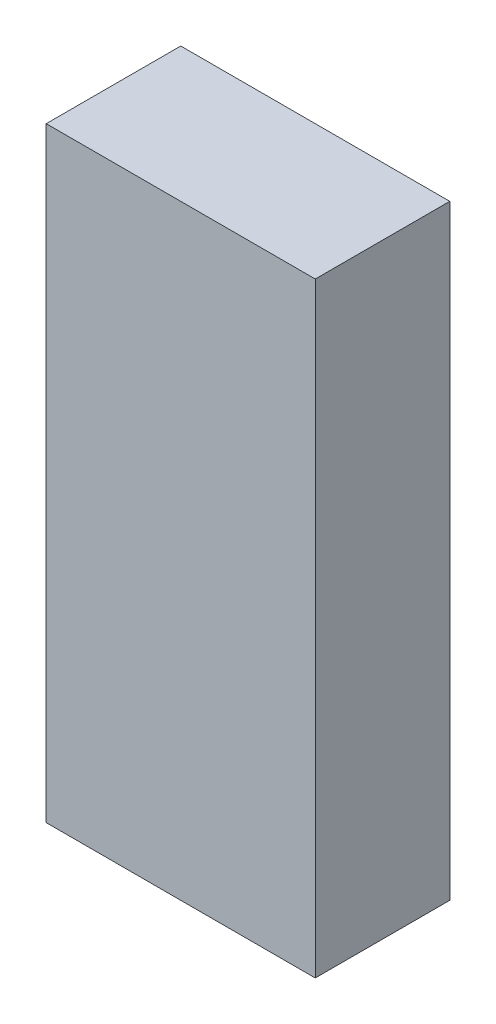
ISO-10303-21;
HEADER;
FILE_DESCRIPTION(('STEP AP214'),'2;1');
FILE_NAME('part.step','',(''),(''),'','','');
FILE_SCHEMA(('AUTOMOTIVE_DESIGN { 1 0 10303 214 1 1 1 1 }'));
ENDSEC;
DATA;
#1=APPLICATION_CONTEXT('core data for automotive mechanical design processes');
#2=APPLICATION_PROTOCOL_DEFINITION('international standard','automotive_design',2000,#1);
#3=PRODUCT_CONTEXT('',#1,'mechanical');
#4=PRODUCT('Part','Part','',(#3));
#5=PRODUCT_RELATED_PRODUCT_CATEGORY('part','',(#4));
#6=PRODUCT_DEFINITION_FORMATION('','',#4);
#7=PRODUCT_DEFINITION_CONTEXT('part definition',#1,'design');
#8=PRODUCT_DEFINITION('design','',#6,#7);
#9=PRODUCT_DEFINITION_SHAPE('','',#8);
#10=(LENGTH_UNIT() NAMED_UNIT(*) SI_UNIT(.MILLI.,.METRE.));
#11=(NAMED_UNIT(*) PLANE_ANGLE_UNIT() SI_UNIT($,.RADIAN.));
#12=(NAMED_UNIT(*) SI_UNIT($,.STERADIAN.) SOLID_ANGLE_UNIT());
#13=UNCERTAINTY_MEASURE_WITH_UNIT(LENGTH_MEASURE(1.E-05),#10,'distance_accuracy_value','');
#14=(GEOMETRIC_REPRESENTATION_CONTEXT(3) GLOBAL_UNCERTAINTY_ASSIGNED_CONTEXT((#13)) GLOBAL_UNIT_ASSIGNED_CONTEXT((#10,
#11,#12)) REPRESENTATION_CONTEXT('',''));
#15=CARTESIAN_POINT('',(0.,0.,0.));
#16=DIRECTION('',(0.,0.,1.));
#17=DIRECTION('',(1.,0.,0.));
#18=AXIS2_PLACEMENT_3D('',#15,#16,#17);
#19=CARTESIAN_POINT('',(-0.6,2.525,0.));
#20=DIRECTION('',(1.,0.,0.));
#21=DIRECTION('',(0.,0.,1.));
#22=AXIS2_PLACEMENT_3D('',#19,#20,#21);
#23=PLANE('',#22);
#24=DIRECTION('',(0.,1.,0.));
#25=VECTOR('',#24,1.);
#26=CARTESIAN_POINT('',(-0.6,2.525,0.1));
#27=LINE('',#26,#25);
#28=CARTESIAN_POINT('',(-0.6,2.525,0.1));
#29=VERTEX_POINT('',#28);
#30=CARTESIAN_POINT('',(-0.6,2.975,0.1));
#31=VERTEX_POINT('',#30);
#32=EDGE_CURVE('E11',#29,#31,#27,.T.);
#33=ORIENTED_EDGE('',*,*,#32,.T.);
#34=DIRECTION('',(0.,0.,1.));
#35=VECTOR('',#34,1.);
#36=CARTESIAN_POINT('',(-0.6,2.975,0.));
#37=LINE('',#36,#35);
#38=CARTESIAN_POINT('',(-0.6,2.975,0.));
#39=VERTEX_POINT('',#38);
#40=EDGE_CURVE('E24',#39,#31,#37,.T.);
#41=ORIENTED_EDGE('',*,*,#40,.F.);
#42=DIRECTION('',(0.,1.,0.));
#43=VECTOR('',#42,1.);
#44=CARTESIAN_POINT('',(-0.6,2.525,0.));
#45=LINE('',#44,#43);
#46=CARTESIAN_POINT('',(-0.6,2.525,0.));
#47=VERTEX_POINT('',#46);
#48=EDGE_CURVE('E86',#47,#39,#45,.T.);
#49=ORIENTED_EDGE('',*,*,#48,.F.);
#50=DIRECTION('',(0.,0.,1.));
#51=VECTOR('',#50,1.);
#52=CARTESIAN_POINT('',(-0.6,2.525,0.));
#53=LINE('',#52,#51);
#54=EDGE_CURVE('E36',#47,#29,#53,.T.);
#55=ORIENTED_EDGE('',*,*,#54,.T.);
#56=EDGE_LOOP('',(#33,#41,#49,#55));
#57=FACE_BOUND('',#56,.T.);
#58=ADVANCED_FACE('F17',(#57),#23,.F.);
#59=CARTESIAN_POINT('',(-0.4,2.525,0.));
#60=DIRECTION('',(1.,0.,0.));
#61=DIRECTION('',(0.,0.,1.));
#62=AXIS2_PLACEMENT_3D('',#59,#60,#61);
#63=PLANE('',#62);
#64=DIRECTION('',(0.,0.,1.));
#65=VECTOR('',#64,1.);
#66=CARTESIAN_POINT('',(-0.4,2.525,0.));
#67=LINE('',#66,#65);
#68=CARTESIAN_POINT('',(-0.4,2.525,0.));
#69=VERTEX_POINT('',#68);
#70=CARTESIAN_POINT('',(-0.4,2.525,0.1));
#71=VERTEX_POINT('',#70);
#72=EDGE_CURVE('E83',#69,#71,#67,.T.);
#73=ORIENTED_EDGE('',*,*,#72,.F.);
#74=DIRECTION('',(0.,1.,0.));
#75=VECTOR('',#74,1.);
#76=CARTESIAN_POINT('',(-0.4,2.525,0.));
#77=LINE('',#76,#75);
#78=CARTESIAN_POINT('',(-0.4,2.975,0.));
#79=VERTEX_POINT('',#78);
#80=EDGE_CURVE('E63',#69,#79,#77,.T.);
#81=ORIENTED_EDGE('',*,*,#80,.T.);
#82=DIRECTION('',(0.,0.,1.));
#83=VECTOR('',#82,1.);
#84=CARTESIAN_POINT('',(-0.4,2.975,0.));
#85=LINE('',#84,#83);
#86=CARTESIAN_POINT('',(-0.4,2.975,0.1));
#87=VERTEX_POINT('',#86);
#88=EDGE_CURVE('E57',#79,#87,#85,.T.);
#89=ORIENTED_EDGE('',*,*,#88,.T.);
#90=DIRECTION('',(0.,1.,0.));
#91=VECTOR('',#90,1.);
#92=CARTESIAN_POINT('',(-0.4,2.525,0.1));
#93=LINE('',#92,#91);
#94=EDGE_CURVE('E60',#71,#87,#93,.T.);
#95=ORIENTED_EDGE('',*,*,#94,.F.);
#96=EDGE_LOOP('',(#73,#81,#89,#95));
#97=FACE_BOUND('',#96,.T.);
#98=ADVANCED_FACE('F59',(#97),#63,.T.);
#99=CARTESIAN_POINT('',(-0.6,2.525,0.));
#100=DIRECTION('',(0.,1.,0.));
#101=DIRECTION('',(0.,0.,1.));
#102=AXIS2_PLACEMENT_3D('',#99,#100,#101);
#103=PLANE('',#102);
#104=ORIENTED_EDGE('',*,*,#72,.T.);
#105=DIRECTION('',(1.,0.,0.));
#106=VECTOR('',#105,1.);
#107=CARTESIAN_POINT('',(-0.6,2.525,0.1));
#108=LINE('',#107,#106);
#109=EDGE_CURVE('E71',#29,#71,#108,.T.);
#110=ORIENTED_EDGE('',*,*,#109,.F.);
#111=ORIENTED_EDGE('',*,*,#54,.F.);
#112=DIRECTION('',(1.,0.,0.));
#113=VECTOR('',#112,1.);
#114=CARTESIAN_POINT('',(-0.6,2.525,0.));
#115=LINE('',#114,#113);
#116=EDGE_CURVE('E76',#47,#69,#115,.T.);
#117=ORIENTED_EDGE('',*,*,#116,.T.);
#118=EDGE_LOOP('',(#104,#110,#111,#117));
#119=FACE_BOUND('',#118,.T.);
#120=ADVANCED_FACE('F91',(#119),#103,.F.);
#121=CARTESIAN_POINT('',(-0.6,2.975,0.));
#122=DIRECTION('',(0.,1.,0.));
#123=DIRECTION('',(0.,0.,1.));
#124=AXIS2_PLACEMENT_3D('',#121,#122,#123);
#125=PLANE('',#124);
#126=DIRECTION('',(1.,0.,0.));
#127=VECTOR('',#126,1.);
#128=CARTESIAN_POINT('',(-0.6,2.975,0.));
#129=LINE('',#128,#127);
#130=EDGE_CURVE('E74',#39,#79,#129,.T.);
#131=ORIENTED_EDGE('',*,*,#130,.F.);
#132=ORIENTED_EDGE('',*,*,#40,.T.);
#133=DIRECTION('',(1.,0.,0.));
#134=VECTOR('',#133,1.);
#135=CARTESIAN_POINT('',(-0.6,2.975,0.1));
#136=LINE('',#135,#134);
#137=EDGE_CURVE('E69',#31,#87,#136,.T.);
#138=ORIENTED_EDGE('',*,*,#137,.T.);
#139=ORIENTED_EDGE('',*,*,#88,.F.);
#140=EDGE_LOOP('',(#131,#132,#138,#139));
#141=FACE_BOUND('',#140,.T.);
#142=ADVANCED_FACE('F73',(#141),#125,.T.);
#143=CARTESIAN_POINT('',(-0.6,2.525,0.));
#144=DIRECTION('',(0.,0.,1.));
#145=DIRECTION('',(1.,0.,0.));
#146=AXIS2_PLACEMENT_3D('',#143,#144,#145);
#147=PLANE('',#146);
#148=ORIENTED_EDGE('',*,*,#130,.T.);
#149=ORIENTED_EDGE('',*,*,#80,.F.);
#150=ORIENTED_EDGE('',*,*,#116,.F.);
#151=ORIENTED_EDGE('',*,*,#48,.T.);
#152=EDGE_LOOP('',(#148,#149,#150,#151));
#153=FACE_BOUND('',#152,.T.);
#154=ADVANCED_FACE('F89',(#153),#147,.F.);
#155=CARTESIAN_POINT('',(-0.6,2.525,0.1));
#156=DIRECTION('',(0.,0.,1.));
#157=DIRECTION('',(1.,0.,0.));
#158=AXIS2_PLACEMENT_3D('',#155,#156,#157);
#159=PLANE('',#158);
#160=ORIENTED_EDGE('',*,*,#32,.F.);
#161=ORIENTED_EDGE('',*,*,#109,.T.);
#162=ORIENTED_EDGE('',*,*,#94,.T.);
#163=ORIENTED_EDGE('',*,*,#137,.F.);
#164=EDGE_LOOP('',(#160,#161,#162,#163));
#165=FACE_BOUND('',#164,.T.);
#166=ADVANCED_FACE('F68',(#165),#159,.T.);
#167=CLOSED_SHELL('',(#58,#98,#120,#142,#154,#166));
#168=MANIFOLD_SOLID_BREP('B1',#167);
#169=ADVANCED_BREP_SHAPE_REPRESENTATION('',(#18,#168),#14);
#170=SHAPE_DEFINITION_REPRESENTATION(#9,#169);
ENDSEC;
END-ISO-10303-21;
